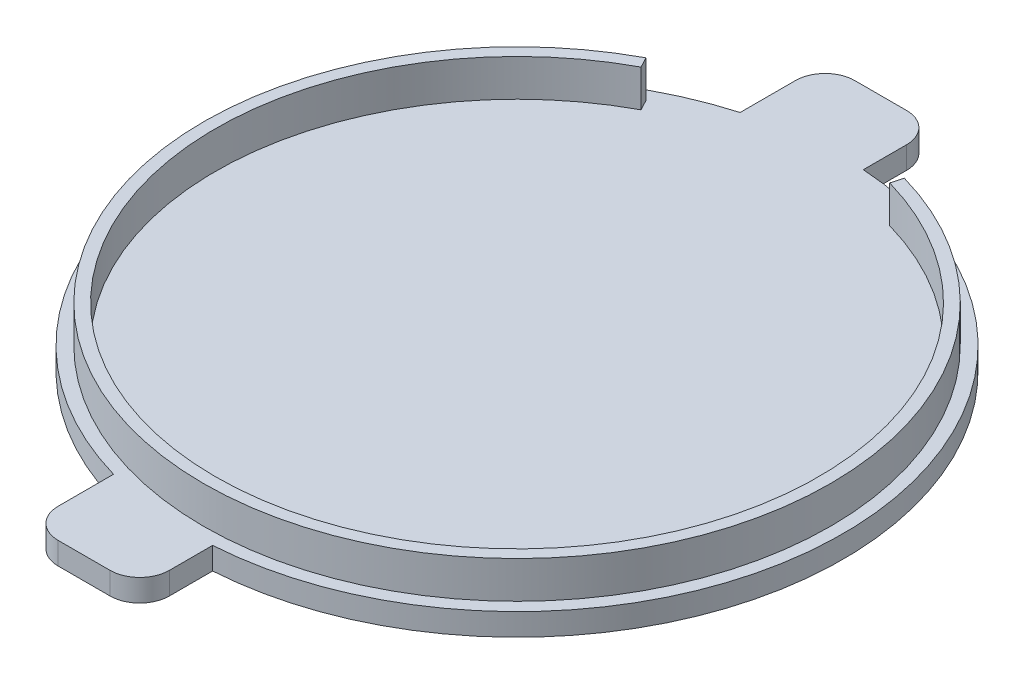
ISO-10303-21;
HEADER;
FILE_DESCRIPTION(('STEP AP214'),'2;1');
FILE_NAME('part.step','',(''),(''),'','','');
FILE_SCHEMA(('AUTOMOTIVE_DESIGN { 1 0 10303 214 1 1 1 1 }'));
ENDSEC;
DATA;
#1=APPLICATION_CONTEXT('core data for automotive mechanical design processes');
#2=APPLICATION_PROTOCOL_DEFINITION('international standard','automotive_design',2000,#1);
#3=PRODUCT_CONTEXT('',#1,'mechanical');
#4=PRODUCT('Part','Part','',(#3));
#5=PRODUCT_RELATED_PRODUCT_CATEGORY('part','',(#4));
#6=PRODUCT_DEFINITION_FORMATION('','',#4);
#7=PRODUCT_DEFINITION_CONTEXT('part definition',#1,'design');
#8=PRODUCT_DEFINITION('design','',#6,#7);
#9=PRODUCT_DEFINITION_SHAPE('','',#8);
#10=(LENGTH_UNIT() NAMED_UNIT(*) SI_UNIT(.MILLI.,.METRE.));
#11=(NAMED_UNIT(*) PLANE_ANGLE_UNIT() SI_UNIT($,.RADIAN.));
#12=(NAMED_UNIT(*) SI_UNIT($,.STERADIAN.) SOLID_ANGLE_UNIT());
#13=UNCERTAINTY_MEASURE_WITH_UNIT(LENGTH_MEASURE(1.E-05),#10,'distance_accuracy_value','');
#14=(GEOMETRIC_REPRESENTATION_CONTEXT(3) GLOBAL_UNCERTAINTY_ASSIGNED_CONTEXT((#13)) GLOBAL_UNIT_ASSIGNED_CONTEXT((#10,
#11,#12)) REPRESENTATION_CONTEXT('',''));
#15=CARTESIAN_POINT('',(0.,0.,0.));
#16=DIRECTION('',(0.,0.,1.));
#17=DIRECTION('',(1.,0.,0.));
#18=AXIS2_PLACEMENT_3D('',#15,#16,#17);
#19=CARTESIAN_POINT('',(0.,3.,0.));
#20=DIRECTION('',(0.,-1.,0.));
#21=DIRECTION('',(0.,0.,-1.));
#22=AXIS2_PLACEMENT_3D('',#19,#20,#21);
#23=CYLINDRICAL_SURFACE('',#22,44.);
#24=DIRECTION('',(0.,-1.,0.));
#25=VECTOR('',#24,1.);
#26=CARTESIAN_POINT('',(2.82657457206034,3.,43.9091160943668));
#27=LINE('',#26,#25);
#28=CARTESIAN_POINT('',(2.82657457206034,0.,43.9091160943668));
#29=VERTEX_POINT('',#28);
#30=CARTESIAN_POINT('',(2.82657457206034,3.,43.9091160943668));
#31=VERTEX_POINT('',#30);
#32=EDGE_CURVE('E57',#29,#31,#27,.F.);
#33=ORIENTED_EDGE('',*,*,#32,.F.);
#34=CARTESIAN_POINT('',(0.,0.,0.));
#35=DIRECTION('',(0.,1.,0.));
#36=DIRECTION('',(0.,0.,1.));
#37=AXIS2_PLACEMENT_3D('',#34,#35,#36);
#38=CIRCLE('',#37,44.);
#39=CARTESIAN_POINT('',(2.82657457206034,0.,-43.9091160943668));
#40=VERTEX_POINT('',#39);
#41=EDGE_CURVE('E262',#29,#40,#38,.T.);
#42=ORIENTED_EDGE('',*,*,#41,.T.);
#43=DIRECTION('',(0.,-1.,0.));
#44=VECTOR('',#43,1.);
#45=CARTESIAN_POINT('',(2.82657457206034,3.,-43.9091160943668));
#46=LINE('',#45,#44);
#47=CARTESIAN_POINT('',(2.82657457206034,3.,-43.9091160943668));
#48=VERTEX_POINT('',#47);
#49=EDGE_CURVE('E231',#40,#48,#46,.F.);
#50=ORIENTED_EDGE('',*,*,#49,.T.);
#51=CARTESIAN_POINT('',(0.,3.,0.));
#52=DIRECTION('',(0.,1.,0.));
#53=DIRECTION('',(0.,0.,1.));
#54=AXIS2_PLACEMENT_3D('',#51,#52,#53);
#55=CIRCLE('',#54,44.);
#56=EDGE_CURVE('E43',#31,#48,#55,.T.);
#57=ORIENTED_EDGE('',*,*,#56,.F.);
#58=EDGE_LOOP('',(#33,#42,#50,#57));
#59=FACE_BOUND('',#58,.T.);
#60=ADVANCED_FACE('F34',(#59),#23,.T.);
#61=CARTESIAN_POINT('',(0.,3.,0.));
#62=DIRECTION('',(0.,1.,0.));
#63=DIRECTION('',(0.,0.,1.));
#64=AXIS2_PLACEMENT_3D('',#61,#62,#63);
#65=PLANE('',#64);
#66=DIRECTION('',(-0.470967650052786,0.,-0.882150481836153));
#67=VECTOR('',#66,1.);
#68=CARTESIAN_POINT('',(-19.1683833571484,3.,-35.9035246107314));
#69=LINE('',#68,#67);
#70=CARTESIAN_POINT('',(-19.1683833571484,3.,-35.9035246107314));
#71=VERTEX_POINT('',#70);
#72=CARTESIAN_POINT('',(-19.9219315972328,3.,-37.3149653816693));
#73=VERTEX_POINT('',#72);
#74=EDGE_CURVE('E247',#71,#73,#69,.T.);
#75=ORIENTED_EDGE('',*,*,#74,.F.);
#76=CARTESIAN_POINT('',(0.,3.,0.));
#77=DIRECTION('',(0.,-1.,0.));
#78=DIRECTION('',(0.,0.,1.));
#79=AXIS2_PLACEMENT_3D('',#76,#77,#78);
#80=CIRCLE('',#79,40.7);
#81=CARTESIAN_POINT('',(11.1521028428794,3.,-39.1423121721474));
#82=VERTEX_POINT('',#81);
#83=EDGE_CURVE('E234',#82,#71,#80,.T.);
#84=ORIENTED_EDGE('',*,*,#83,.F.);
#85=DIRECTION('',(-0.274007440856989,0.,0.961727571797234));
#86=VECTOR('',#85,1.);
#87=CARTESIAN_POINT('',(11.1521028428794,3.,-39.1423121721474));
#88=LINE('',#87,#86);
#89=CARTESIAN_POINT('',(11.5905147482506,3.,-40.681076287023));
#90=VERTEX_POINT('',#89);
#91=EDGE_CURVE('E239',#90,#82,#88,.T.);
#92=ORIENTED_EDGE('',*,*,#91,.F.);
#93=CARTESIAN_POINT('',(0.,3.,0.));
#94=DIRECTION('',(0.,1.,0.));
#95=DIRECTION('',(0.,0.,1.));
#96=AXIS2_PLACEMENT_3D('',#93,#94,#95);
#97=CIRCLE('',#96,42.3);
#98=EDGE_CURVE('E249',#73,#90,#97,.T.);
#99=ORIENTED_EDGE('',*,*,#98,.F.);
#100=EDGE_LOOP('',(#75,#84,#92,#99));
#101=FACE_BOUND('',#100,.T.);
#102=CARTESIAN_POINT('',(-12.1734254279397,3.,-42.2824752509877));
#103=VERTEX_POINT('',#102);
#104=CARTESIAN_POINT('',(-12.1734254279397,3.,42.2824752509878));
#105=VERTEX_POINT('',#104);
#106=EDGE_CURVE('E11',#103,#105,#55,.T.);
#107=ORIENTED_EDGE('',*,*,#106,.T.);
#108=DIRECTION('',(0.,0.,-1.));
#109=VECTOR('',#108,1.);
#110=CARTESIAN_POINT('',(-12.1734254279397,3.,49.7511039262953));
#111=LINE('',#110,#109);
#112=CARTESIAN_POINT('',(-12.1734254279397,3.,49.7511039262953));
#113=VERTEX_POINT('',#112);
#114=EDGE_CURVE('E153',#113,#105,#111,.T.);
#115=ORIENTED_EDGE('',*,*,#114,.F.);
#116=CARTESIAN_POINT('',(-8.17342542793966,3.,49.7511039262953));
#117=DIRECTION('',(0.,1.,0.));
#118=DIRECTION('',(0.,0.,1.));
#119=AXIS2_PLACEMENT_3D('',#116,#117,#118);
#120=CIRCLE('',#119,4.);
#121=CARTESIAN_POINT('',(-8.17342542793966,3.00000000000001,53.7511039262953));
#122=VERTEX_POINT('',#121);
#123=EDGE_CURVE('E146',#113,#122,#120,.T.);
#124=ORIENTED_EDGE('',*,*,#123,.T.);
#125=DIRECTION('',(-1.,0.,0.));
#126=VECTOR('',#125,1.);
#127=CARTESIAN_POINT('',(-1.17342542793966,3.,53.7511039262953));
#128=LINE('',#127,#126);
#129=CARTESIAN_POINT('',(-1.17342542793966,3.,53.7511039262953));
#130=VERTEX_POINT('',#129);
#131=EDGE_CURVE('E150',#130,#122,#128,.T.);
#132=ORIENTED_EDGE('',*,*,#131,.F.);
#133=CARTESIAN_POINT('',(-1.17342542793966,3.,49.7511039262953));
#134=DIRECTION('',(0.,1.,0.));
#135=DIRECTION('',(0.,0.,1.));
#136=AXIS2_PLACEMENT_3D('',#133,#134,#135);
#137=CIRCLE('',#136,4.);
#138=CARTESIAN_POINT('',(2.82657457206034,3.,49.7511039262953));
#139=VERTEX_POINT('',#138);
#140=EDGE_CURVE('E180',#139,#130,#137,.F.);
#141=ORIENTED_EDGE('',*,*,#140,.F.);
#142=DIRECTION('',(0.,0.,-1.));
#143=VECTOR('',#142,1.);
#144=CARTESIAN_POINT('',(2.82657457206034,3.,49.7511039262953));
#145=LINE('',#144,#143);
#146=EDGE_CURVE('E157',#139,#31,#145,.T.);
#147=ORIENTED_EDGE('',*,*,#146,.T.);
#148=ORIENTED_EDGE('',*,*,#56,.T.);
#149=DIRECTION('',(0.,0.,1.));
#150=VECTOR('',#149,1.);
#151=CARTESIAN_POINT('',(2.82657457206034,3.,-49.7511039262953));
#152=LINE('',#151,#150);
#153=CARTESIAN_POINT('',(2.82657457206034,3.,-49.7511039262953));
#154=VERTEX_POINT('',#153);
#155=EDGE_CURVE('E205',#154,#48,#152,.T.);
#156=ORIENTED_EDGE('',*,*,#155,.F.);
#157=CARTESIAN_POINT('',(-1.17342542793966,3.,-49.7511039262953));
#158=DIRECTION('',(0.,1.,0.));
#159=DIRECTION('',(0.,0.,1.));
#160=AXIS2_PLACEMENT_3D('',#157,#158,#159);
#161=CIRCLE('',#160,4.);
#162=CARTESIAN_POINT('',(-1.17342542793966,3.,-53.7511039262953));
#163=VERTEX_POINT('',#162);
#164=EDGE_CURVE('E192',#154,#163,#161,.T.);
#165=ORIENTED_EDGE('',*,*,#164,.T.);
#166=DIRECTION('',(-1.,0.,0.));
#167=VECTOR('',#166,1.);
#168=CARTESIAN_POINT('',(-1.17342542793966,3.,-53.7511039262953));
#169=LINE('',#168,#167);
#170=CARTESIAN_POINT('',(-8.17342542793966,3.,-53.7511039262953));
#171=VERTEX_POINT('',#170);
#172=EDGE_CURVE('E218',#163,#171,#169,.T.);
#173=ORIENTED_EDGE('',*,*,#172,.T.);
#174=CARTESIAN_POINT('',(-8.17342542793966,3.,-49.7511039262953));
#175=DIRECTION('',(0.,1.,0.));
#176=DIRECTION('',(0.,0.,1.));
#177=AXIS2_PLACEMENT_3D('',#174,#175,#176);
#178=CIRCLE('',#177,4.);
#179=CARTESIAN_POINT('',(-12.1734254279397,3.,-49.7511039262953));
#180=VERTEX_POINT('',#179);
#181=EDGE_CURVE('E201',#180,#171,#178,.F.);
#182=ORIENTED_EDGE('',*,*,#181,.F.);
#183=DIRECTION('',(0.,0.,1.));
#184=VECTOR('',#183,1.);
#185=CARTESIAN_POINT('',(-12.1734254279397,3.,-49.7511039262953));
#186=LINE('',#185,#184);
#187=EDGE_CURVE('E197',#180,#103,#186,.T.);
#188=ORIENTED_EDGE('',*,*,#187,.T.);
#189=EDGE_LOOP('',(#107,#115,#124,#132,#141,#147,#148,#156,#165,#173,#182,#188));
#190=FACE_BOUND('',#189,.T.);
#191=ADVANCED_FACE('F148',(#101,#190),#65,.T.);
#192=CARTESIAN_POINT('',(-12.1734254279397,0.,-42.2824752509878));
#193=VERTEX_POINT('',#192);
#194=CARTESIAN_POINT('',(-12.1734254279397,0.,42.2824752509878));
#195=VERTEX_POINT('',#194);
#196=EDGE_CURVE('E38',#193,#195,#38,.T.);
#197=ORIENTED_EDGE('',*,*,#196,.T.);
#198=DIRECTION('',(0.,-1.,0.));
#199=VECTOR('',#198,1.);
#200=CARTESIAN_POINT('',(-12.1734254279397,3.,42.2824752509877));
#201=LINE('',#200,#199);
#202=EDGE_CURVE('E50',#195,#105,#201,.F.);
#203=ORIENTED_EDGE('',*,*,#202,.T.);
#204=ORIENTED_EDGE('',*,*,#106,.F.);
#205=DIRECTION('',(0.,-1.,0.));
#206=VECTOR('',#205,1.);
#207=CARTESIAN_POINT('',(-12.1734254279397,3.,-42.2824752509877));
#208=LINE('',#207,#206);
#209=EDGE_CURVE('E214',#193,#103,#208,.F.);
#210=ORIENTED_EDGE('',*,*,#209,.F.);
#211=EDGE_LOOP('',(#197,#203,#204,#210));
#212=FACE_BOUND('',#211,.T.);
#213=ADVANCED_FACE('F36',(#212),#23,.T.);
#214=CARTESIAN_POINT('',(0.,0.,0.));
#215=DIRECTION('',(0.,1.,0.));
#216=DIRECTION('',(0.,0.,1.));
#217=AXIS2_PLACEMENT_3D('',#214,#215,#216);
#218=PLANE('',#217);
#219=ORIENTED_EDGE('',*,*,#41,.F.);
#220=DIRECTION('',(0.,0.,-1.));
#221=VECTOR('',#220,1.);
#222=CARTESIAN_POINT('',(2.82657457206034,0.,49.7511039262953));
#223=LINE('',#222,#221);
#224=CARTESIAN_POINT('',(2.82657457206034,0.,49.7511039262953));
#225=VERTEX_POINT('',#224);
#226=EDGE_CURVE('E182',#225,#29,#223,.T.);
#227=ORIENTED_EDGE('',*,*,#226,.F.);
#228=CARTESIAN_POINT('',(-1.17342542793966,0.,49.7511039262953));
#229=DIRECTION('',(0.,-1.,0.));
#230=DIRECTION('',(0.,0.,-1.));
#231=AXIS2_PLACEMENT_3D('',#228,#229,#230);
#232=CIRCLE('',#231,4.);
#233=CARTESIAN_POINT('',(-1.17342542793966,0.,53.7511039262953));
#234=VERTEX_POINT('',#233);
#235=EDGE_CURVE('E156',#225,#234,#232,.T.);
#236=ORIENTED_EDGE('',*,*,#235,.T.);
#237=DIRECTION('',(-1.,0.,0.));
#238=VECTOR('',#237,1.);
#239=CARTESIAN_POINT('',(-1.17342542793966,0.,53.7511039262953));
#240=LINE('',#239,#238);
#241=CARTESIAN_POINT('',(-8.17342542793966,0.,53.7511039262953));
#242=VERTEX_POINT('',#241);
#243=EDGE_CURVE('E175',#234,#242,#240,.T.);
#244=ORIENTED_EDGE('',*,*,#243,.T.);
#245=CARTESIAN_POINT('',(-8.17342542793966,0.,49.7511039262953));
#246=DIRECTION('',(0.,1.,0.));
#247=DIRECTION('',(0.,0.,1.));
#248=AXIS2_PLACEMENT_3D('',#245,#246,#247);
#249=CIRCLE('',#248,4.);
#250=CARTESIAN_POINT('',(-12.1734254279397,0.,49.7511039262953));
#251=VERTEX_POINT('',#250);
#252=EDGE_CURVE('E163',#251,#242,#249,.T.);
#253=ORIENTED_EDGE('',*,*,#252,.F.);
#254=DIRECTION('',(0.,0.,-1.));
#255=VECTOR('',#254,1.);
#256=CARTESIAN_POINT('',(-12.1734254279397,0.,49.7511039262953));
#257=LINE('',#256,#255);
#258=EDGE_CURVE('E172',#251,#195,#257,.T.);
#259=ORIENTED_EDGE('',*,*,#258,.T.);
#260=ORIENTED_EDGE('',*,*,#196,.F.);
#261=DIRECTION('',(0.,0.,1.));
#262=VECTOR('',#261,1.);
#263=CARTESIAN_POINT('',(-12.1734254279397,0.,-49.7511039262953));
#264=LINE('',#263,#262);
#265=CARTESIAN_POINT('',(-12.1734254279397,0.,-49.7511039262953));
#266=VERTEX_POINT('',#265);
#267=EDGE_CURVE('E198',#266,#193,#264,.T.);
#268=ORIENTED_EDGE('',*,*,#267,.F.);
#269=CARTESIAN_POINT('',(-8.17342542793966,0.,-49.7511039262953));
#270=DIRECTION('',(0.,-1.,0.));
#271=DIRECTION('',(0.,0.,-1.));
#272=AXIS2_PLACEMENT_3D('',#269,#270,#271);
#273=CIRCLE('',#272,4.);
#274=CARTESIAN_POINT('',(-8.17342542793966,0.,-53.7511039262953));
#275=VERTEX_POINT('',#274);
#276=EDGE_CURVE('E196',#266,#275,#273,.T.);
#277=ORIENTED_EDGE('',*,*,#276,.T.);
#278=DIRECTION('',(-1.,0.,0.));
#279=VECTOR('',#278,1.);
#280=CARTESIAN_POINT('',(-1.17342542793966,0.,-53.7511039262953));
#281=LINE('',#280,#279);
#282=CARTESIAN_POINT('',(-1.17342542793966,0.,-53.7511039262953));
#283=VERTEX_POINT('',#282);
#284=EDGE_CURVE('E206',#283,#275,#281,.T.);
#285=ORIENTED_EDGE('',*,*,#284,.F.);
#286=CARTESIAN_POINT('',(-1.17342542793966,0.,-49.7511039262953));
#287=DIRECTION('',(0.,1.,0.));
#288=DIRECTION('',(0.,0.,1.));
#289=AXIS2_PLACEMENT_3D('',#286,#287,#288);
#290=CIRCLE('',#289,4.);
#291=CARTESIAN_POINT('',(2.82657457206034,0.,-49.7511039262953));
#292=VERTEX_POINT('',#291);
#293=EDGE_CURVE('E211',#292,#283,#290,.T.);
#294=ORIENTED_EDGE('',*,*,#293,.F.);
#295=DIRECTION('',(0.,0.,1.));
#296=VECTOR('',#295,1.);
#297=CARTESIAN_POINT('',(2.82657457206034,0.,-49.7511039262953));
#298=LINE('',#297,#296);
#299=EDGE_CURVE('E193',#292,#40,#298,.T.);
#300=ORIENTED_EDGE('',*,*,#299,.T.);
#301=EDGE_LOOP('',(#219,#227,#236,#244,#253,#259,#260,#268,#277,#285,#294,#300));
#302=FACE_BOUND('',#301,.T.);
#303=ADVANCED_FACE('F280',(#302),#218,.F.);
#304=CARTESIAN_POINT('',(0.,8.,0.));
#305=DIRECTION('',(0.,-1.,0.));
#306=DIRECTION('',(0.,0.,-1.));
#307=AXIS2_PLACEMENT_3D('',#304,#305,#306);
#308=CYLINDRICAL_SURFACE('',#307,40.7);
#309=ORIENTED_EDGE('',*,*,#83,.T.);
#310=DIRECTION('',(0.,-1.,0.));
#311=VECTOR('',#310,1.);
#312=CARTESIAN_POINT('',(-19.1683833571484,8.,-35.9035246107314));
#313=LINE('',#312,#311);
#314=CARTESIAN_POINT('',(-19.1683833571484,8.,-35.9035246107314));
#315=VERTEX_POINT('',#314);
#316=EDGE_CURVE('E260',#315,#71,#313,.T.);
#317=ORIENTED_EDGE('',*,*,#316,.F.);
#318=CARTESIAN_POINT('',(0.,8.,0.));
#319=DIRECTION('',(0.,-1.,0.));
#320=DIRECTION('',(0.,0.,1.));
#321=AXIS2_PLACEMENT_3D('',#318,#319,#320);
#322=CIRCLE('',#321,40.7);
#323=CARTESIAN_POINT('',(11.1521028428794,8.,-39.1423121721474));
#324=VERTEX_POINT('',#323);
#325=EDGE_CURVE('E235',#324,#315,#322,.T.);
#326=ORIENTED_EDGE('',*,*,#325,.F.);
#327=DIRECTION('',(0.,-1.,0.));
#328=VECTOR('',#327,1.);
#329=CARTESIAN_POINT('',(11.1521028428794,8.,-39.1423121721474));
#330=LINE('',#329,#328);
#331=EDGE_CURVE('E245',#324,#82,#330,.T.);
#332=ORIENTED_EDGE('',*,*,#331,.T.);
#333=EDGE_LOOP('',(#309,#317,#326,#332));
#334=FACE_BOUND('',#333,.T.);
#335=ADVANCED_FACE('F317',(#334),#308,.F.);
#336=CARTESIAN_POINT('',(-19.1683833571484,8.,-35.9035246107314));
#337=DIRECTION('',(-0.882150481836153,0.,0.470967650052786));
#338=DIRECTION('',(0.470967650052786,0.,0.882150481836153));
#339=AXIS2_PLACEMENT_3D('',#336,#337,#338);
#340=PLANE('',#339);
#341=ORIENTED_EDGE('',*,*,#74,.T.);
#342=DIRECTION('',(0.,-1.,0.));
#343=VECTOR('',#342,1.);
#344=CARTESIAN_POINT('',(-19.9219315972328,8.,-37.3149653816693));
#345=LINE('',#344,#343);
#346=CARTESIAN_POINT('',(-19.9219315972328,8.,-37.3149653816693));
#347=VERTEX_POINT('',#346);
#348=EDGE_CURVE('E257',#347,#73,#345,.T.);
#349=ORIENTED_EDGE('',*,*,#348,.F.);
#350=DIRECTION('',(-0.470967650052786,0.,-0.882150481836153));
#351=VECTOR('',#350,1.);
#352=CARTESIAN_POINT('',(-19.1683833571484,8.,-35.9035246107314));
#353=LINE('',#352,#351);
#354=EDGE_CURVE('E238',#315,#347,#353,.T.);
#355=ORIENTED_EDGE('',*,*,#354,.F.);
#356=ORIENTED_EDGE('',*,*,#316,.T.);
#357=EDGE_LOOP('',(#341,#349,#355,#356));
#358=FACE_BOUND('',#357,.T.);
#359=ADVANCED_FACE('F321',(#358),#340,.F.);
#360=CARTESIAN_POINT('',(0.,8.,0.));
#361=DIRECTION('',(0.,-1.,0.));
#362=DIRECTION('',(0.,0.,-1.));
#363=AXIS2_PLACEMENT_3D('',#360,#361,#362);
#364=CYLINDRICAL_SURFACE('',#363,42.3);
#365=ORIENTED_EDGE('',*,*,#98,.T.);
#366=DIRECTION('',(0.,-1.,0.));
#367=VECTOR('',#366,1.);
#368=CARTESIAN_POINT('',(11.5905147482506,8.,-40.681076287023));
#369=LINE('',#368,#367);
#370=CARTESIAN_POINT('',(11.5905147482506,8.,-40.681076287023));
#371=VERTEX_POINT('',#370);
#372=EDGE_CURVE('E254',#371,#90,#369,.T.);
#373=ORIENTED_EDGE('',*,*,#372,.F.);
#374=CARTESIAN_POINT('',(0.,8.,0.));
#375=DIRECTION('',(0.,1.,0.));
#376=DIRECTION('',(0.,0.,1.));
#377=AXIS2_PLACEMENT_3D('',#374,#375,#376);
#378=CIRCLE('',#377,42.3);
#379=EDGE_CURVE('E241',#347,#371,#378,.T.);
#380=ORIENTED_EDGE('',*,*,#379,.F.);
#381=ORIENTED_EDGE('',*,*,#348,.T.);
#382=EDGE_LOOP('',(#365,#373,#380,#381));
#383=FACE_BOUND('',#382,.T.);
#384=ADVANCED_FACE('F327',(#383),#364,.T.);
#385=CARTESIAN_POINT('',(11.1521028428794,8.,-39.1423121721474));
#386=DIRECTION('',(0.961727571797234,0.,0.274007440856989));
#387=DIRECTION('',(0.274007440856989,0.,-0.961727571797234));
#388=AXIS2_PLACEMENT_3D('',#385,#386,#387);
#389=PLANE('',#388);
#390=ORIENTED_EDGE('',*,*,#91,.T.);
#391=ORIENTED_EDGE('',*,*,#331,.F.);
#392=DIRECTION('',(-0.274007440856989,0.,0.961727571797234));
#393=VECTOR('',#392,1.);
#394=CARTESIAN_POINT('',(11.1521028428794,8.,-39.1423121721474));
#395=LINE('',#394,#393);
#396=EDGE_CURVE('E243',#371,#324,#395,.T.);
#397=ORIENTED_EDGE('',*,*,#396,.F.);
#398=ORIENTED_EDGE('',*,*,#372,.T.);
#399=EDGE_LOOP('',(#390,#391,#397,#398));
#400=FACE_BOUND('',#399,.T.);
#401=ADVANCED_FACE('F330',(#400),#389,.F.);
#402=CARTESIAN_POINT('',(0.,8.,0.));
#403=DIRECTION('',(0.,1.,0.));
#404=DIRECTION('',(0.,0.,1.));
#405=AXIS2_PLACEMENT_3D('',#402,#403,#404);
#406=PLANE('',#405);
#407=ORIENTED_EDGE('',*,*,#325,.T.);
#408=ORIENTED_EDGE('',*,*,#354,.T.);
#409=ORIENTED_EDGE('',*,*,#379,.T.);
#410=ORIENTED_EDGE('',*,*,#396,.T.);
#411=EDGE_LOOP('',(#407,#408,#409,#410));
#412=FACE_BOUND('',#411,.T.);
#413=ADVANCED_FACE('F334',(#412),#406,.T.);
#414=CARTESIAN_POINT('',(2.82657457206034,28.,-49.7511039262953));
#415=DIRECTION('',(1.,0.,0.));
#416=DIRECTION('',(0.,0.,-1.));
#417=AXIS2_PLACEMENT_3D('',#414,#415,#416);
#418=PLANE('',#417);
#419=ORIENTED_EDGE('',*,*,#49,.F.);
#420=ORIENTED_EDGE('',*,*,#299,.F.);
#421=DIRECTION('',(0.,-1.,0.));
#422=VECTOR('',#421,1.);
#423=CARTESIAN_POINT('',(2.82657457206034,28.,-49.7511039262953));
#424=LINE('',#423,#422);
#425=EDGE_CURVE('E209',#154,#292,#424,.T.);
#426=ORIENTED_EDGE('',*,*,#425,.F.);
#427=ORIENTED_EDGE('',*,*,#155,.T.);
#428=EDGE_LOOP('',(#419,#420,#426,#427));
#429=FACE_BOUND('',#428,.T.);
#430=ADVANCED_FACE('F273',(#429),#418,.T.);
#431=CARTESIAN_POINT('',(-12.1734254279397,28.,-49.7511039262953));
#432=DIRECTION('',(1.,0.,0.));
#433=DIRECTION('',(0.,0.,-1.));
#434=AXIS2_PLACEMENT_3D('',#431,#432,#433);
#435=PLANE('',#434);
#436=ORIENTED_EDGE('',*,*,#267,.T.);
#437=ORIENTED_EDGE('',*,*,#209,.T.);
#438=ORIENTED_EDGE('',*,*,#187,.F.);
#439=DIRECTION('',(0.,-1.,0.));
#440=VECTOR('',#439,1.);
#441=CARTESIAN_POINT('',(-12.1734254279397,28.,-49.7511039262953));
#442=LINE('',#441,#440);
#443=EDGE_CURVE('E202',#180,#266,#442,.T.);
#444=ORIENTED_EDGE('',*,*,#443,.T.);
#445=EDGE_LOOP('',(#436,#437,#438,#444));
#446=FACE_BOUND('',#445,.T.);
#447=ADVANCED_FACE('F292',(#446),#435,.F.);
#448=CARTESIAN_POINT('',(-8.17342542793966,28.,-49.7511039262953));
#449=DIRECTION('',(0.,-1.,0.));
#450=DIRECTION('',(0.,0.,-1.));
#451=AXIS2_PLACEMENT_3D('',#448,#449,#450);
#452=CYLINDRICAL_SURFACE('',#451,4.);
#453=ORIENTED_EDGE('',*,*,#443,.F.);
#454=ORIENTED_EDGE('',*,*,#181,.T.);
#455=DIRECTION('',(0.,-1.,0.));
#456=VECTOR('',#455,1.);
#457=CARTESIAN_POINT('',(-8.17342542793966,28.,-53.7511039262953));
#458=LINE('',#457,#456);
#459=EDGE_CURVE('E222',#171,#275,#458,.T.);
#460=ORIENTED_EDGE('',*,*,#459,.T.);
#461=ORIENTED_EDGE('',*,*,#276,.F.);
#462=EDGE_LOOP('',(#453,#454,#460,#461));
#463=FACE_BOUND('',#462,.T.);
#464=ADVANCED_FACE('F290',(#463),#452,.T.);
#465=CARTESIAN_POINT('',(-1.17342542793966,28.,-53.7511039262953));
#466=DIRECTION('',(0.,0.,1.));
#467=DIRECTION('',(1.,0.,0.));
#468=AXIS2_PLACEMENT_3D('',#465,#466,#467);
#469=PLANE('',#468);
#470=ORIENTED_EDGE('',*,*,#172,.F.);
#471=DIRECTION('',(0.,-1.,0.));
#472=VECTOR('',#471,1.);
#473=CARTESIAN_POINT('',(-1.17342542793966,28.,-53.7511039262953));
#474=LINE('',#473,#472);
#475=EDGE_CURVE('E210',#163,#283,#474,.T.);
#476=ORIENTED_EDGE('',*,*,#475,.T.);
#477=ORIENTED_EDGE('',*,*,#284,.T.);
#478=ORIENTED_EDGE('',*,*,#459,.F.);
#479=EDGE_LOOP('',(#470,#476,#477,#478));
#480=FACE_BOUND('',#479,.T.);
#481=ADVANCED_FACE('F286',(#480),#469,.F.);
#482=CARTESIAN_POINT('',(-1.17342542793966,28.,-49.7511039262953));
#483=DIRECTION('',(0.,-1.,0.));
#484=DIRECTION('',(0.,0.,-1.));
#485=AXIS2_PLACEMENT_3D('',#482,#483,#484);
#486=CYLINDRICAL_SURFACE('',#485,4.);
#487=ORIENTED_EDGE('',*,*,#164,.F.);
#488=ORIENTED_EDGE('',*,*,#425,.T.);
#489=ORIENTED_EDGE('',*,*,#293,.T.);
#490=ORIENTED_EDGE('',*,*,#475,.F.);
#491=EDGE_LOOP('',(#487,#488,#489,#490));
#492=FACE_BOUND('',#491,.T.);
#493=ADVANCED_FACE('F276',(#492),#486,.T.);
#494=CARTESIAN_POINT('',(-12.1734254279397,28.,49.7511039262953));
#495=DIRECTION('',(-1.,0.,0.));
#496=DIRECTION('',(0.,0.,1.));
#497=AXIS2_PLACEMENT_3D('',#494,#495,#496);
#498=PLANE('',#497);
#499=ORIENTED_EDGE('',*,*,#202,.F.);
#500=ORIENTED_EDGE('',*,*,#258,.F.);
#501=DIRECTION('',(0.,-1.,0.));
#502=VECTOR('',#501,1.);
#503=CARTESIAN_POINT('',(-12.1734254279397,28.,49.7511039262953));
#504=LINE('',#503,#502);
#505=EDGE_CURVE('E167',#113,#251,#504,.T.);
#506=ORIENTED_EDGE('',*,*,#505,.F.);
#507=ORIENTED_EDGE('',*,*,#114,.T.);
#508=EDGE_LOOP('',(#499,#500,#506,#507));
#509=FACE_BOUND('',#508,.T.);
#510=ADVANCED_FACE('F295',(#509),#498,.T.);
#511=CARTESIAN_POINT('',(2.82657457206034,28.,49.7511039262953));
#512=DIRECTION('',(-1.,0.,0.));
#513=DIRECTION('',(0.,0.,1.));
#514=AXIS2_PLACEMENT_3D('',#511,#512,#513);
#515=PLANE('',#514);
#516=ORIENTED_EDGE('',*,*,#226,.T.);
#517=ORIENTED_EDGE('',*,*,#32,.T.);
#518=ORIENTED_EDGE('',*,*,#146,.F.);
#519=DIRECTION('',(0.,-1.,0.));
#520=VECTOR('',#519,1.);
#521=CARTESIAN_POINT('',(2.82657457206034,28.,49.7511039262953));
#522=LINE('',#521,#520);
#523=EDGE_CURVE('E185',#139,#225,#522,.T.);
#524=ORIENTED_EDGE('',*,*,#523,.T.);
#525=EDGE_LOOP('',(#516,#517,#518,#524));
#526=FACE_BOUND('',#525,.T.);
#527=ADVANCED_FACE('F297',(#526),#515,.F.);
#528=CARTESIAN_POINT('',(-1.17342542793966,28.,53.7511039262953));
#529=DIRECTION('',(0.,0.,1.));
#530=DIRECTION('',(1.,0.,0.));
#531=AXIS2_PLACEMENT_3D('',#528,#529,#530);
#532=PLANE('',#531);
#533=DIRECTION('',(0.,-1.,0.));
#534=VECTOR('',#533,1.);
#535=CARTESIAN_POINT('',(-1.17342542793966,28.,53.7511039262953));
#536=LINE('',#535,#534);
#537=EDGE_CURVE('E171',#130,#234,#536,.T.);
#538=ORIENTED_EDGE('',*,*,#537,.F.);
#539=ORIENTED_EDGE('',*,*,#131,.T.);
#540=DIRECTION('',(0.,-1.,0.));
#541=VECTOR('',#540,1.);
#542=CARTESIAN_POINT('',(-8.17342542793966,28.,53.7511039262953));
#543=LINE('',#542,#541);
#544=EDGE_CURVE('E160',#122,#242,#543,.T.);
#545=ORIENTED_EDGE('',*,*,#544,.T.);
#546=ORIENTED_EDGE('',*,*,#243,.F.);
#547=EDGE_LOOP('',(#538,#539,#545,#546));
#548=FACE_BOUND('',#547,.T.);
#549=ADVANCED_FACE('F170',(#548),#532,.T.);
#550=CARTESIAN_POINT('',(-8.17342542793966,28.,49.7511039262953));
#551=DIRECTION('',(0.,-1.,0.));
#552=DIRECTION('',(0.,0.,-1.));
#553=AXIS2_PLACEMENT_3D('',#550,#551,#552);
#554=CYLINDRICAL_SURFACE('',#553,4.);
#555=ORIENTED_EDGE('',*,*,#123,.F.);
#556=ORIENTED_EDGE('',*,*,#505,.T.);
#557=ORIENTED_EDGE('',*,*,#252,.T.);
#558=ORIENTED_EDGE('',*,*,#544,.F.);
#559=EDGE_LOOP('',(#555,#556,#557,#558));
#560=FACE_BOUND('',#559,.T.);
#561=ADVANCED_FACE('F161',(#560),#554,.T.);
#562=CARTESIAN_POINT('',(-1.17342542793966,28.,49.7511039262953));
#563=DIRECTION('',(0.,-1.,0.));
#564=DIRECTION('',(0.,0.,-1.));
#565=AXIS2_PLACEMENT_3D('',#562,#563,#564);
#566=CYLINDRICAL_SURFACE('',#565,4.);
#567=ORIENTED_EDGE('',*,*,#523,.F.);
#568=ORIENTED_EDGE('',*,*,#140,.T.);
#569=ORIENTED_EDGE('',*,*,#537,.T.);
#570=ORIENTED_EDGE('',*,*,#235,.F.);
#571=EDGE_LOOP('',(#567,#568,#569,#570));
#572=FACE_BOUND('',#571,.T.);
#573=ADVANCED_FACE('F349',(#572),#566,.T.);
#574=CLOSED_SHELL('',(#60,#191,#213,#303,#335,#359,#384,#401,#413,#430,#447,#464,#481,#493,#510,
#527,#549,#561,#573));
#575=MANIFOLD_SOLID_BREP('B2',#574);
#576=ADVANCED_BREP_SHAPE_REPRESENTATION('',(#18,#575),#14);
#577=SHAPE_DEFINITION_REPRESENTATION(#9,#576);
ENDSEC;
END-ISO-10303-21;
